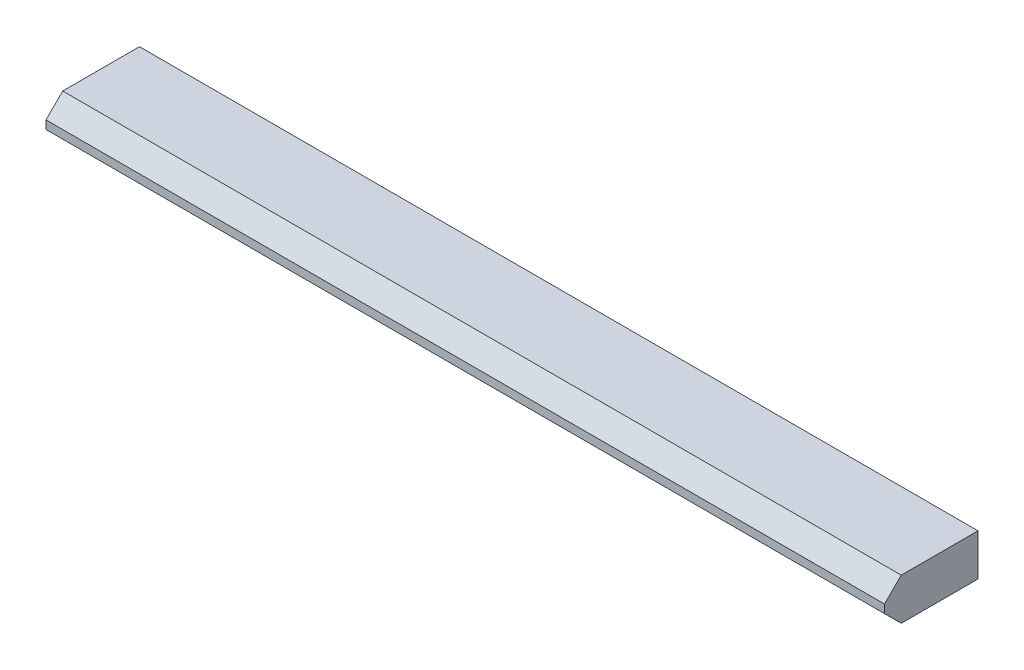
ISO-10303-21;
HEADER;
FILE_DESCRIPTION(('STEP AP214'),'2;1');
FILE_NAME('part.step','',(''),(''),'','','');
FILE_SCHEMA(('AUTOMOTIVE_DESIGN { 1 0 10303 214 1 1 1 1 }'));
ENDSEC;
DATA;
#1=APPLICATION_CONTEXT('core data for automotive mechanical design processes');
#2=APPLICATION_PROTOCOL_DEFINITION('international standard','automotive_design',2000,#1);
#3=PRODUCT_CONTEXT('',#1,'mechanical');
#4=PRODUCT('Part','Part','',(#3));
#5=PRODUCT_RELATED_PRODUCT_CATEGORY('part','',(#4));
#6=PRODUCT_DEFINITION_FORMATION('','',#4);
#7=PRODUCT_DEFINITION_CONTEXT('part definition',#1,'design');
#8=PRODUCT_DEFINITION('design','',#6,#7);
#9=PRODUCT_DEFINITION_SHAPE('','',#8);
#10=(LENGTH_UNIT() NAMED_UNIT(*) SI_UNIT(.MILLI.,.METRE.));
#11=(NAMED_UNIT(*) PLANE_ANGLE_UNIT() SI_UNIT($,.RADIAN.));
#12=(NAMED_UNIT(*) SI_UNIT($,.STERADIAN.) SOLID_ANGLE_UNIT());
#13=UNCERTAINTY_MEASURE_WITH_UNIT(LENGTH_MEASURE(1.E-05),#10,'distance_accuracy_value','');
#14=(GEOMETRIC_REPRESENTATION_CONTEXT(3) GLOBAL_UNCERTAINTY_ASSIGNED_CONTEXT((#13)) GLOBAL_UNIT_ASSIGNED_CONTEXT((#10,
#11,#12)) REPRESENTATION_CONTEXT('',''));
#15=CARTESIAN_POINT('',(0.,0.,0.));
#16=DIRECTION('',(0.,0.,1.));
#17=DIRECTION('',(1.,0.,0.));
#18=AXIS2_PLACEMENT_3D('',#15,#16,#17);
#19=CARTESIAN_POINT('',(-201.,7.7715611723761E-13,25.));
#20=DIRECTION('',(0.,0.,1.));
#21=DIRECTION('',(1.,0.,0.));
#22=AXIS2_PLACEMENT_3D('',#19,#20,#21);
#23=PLANE('',#22);
#24=DIRECTION('',(0.,1.,0.));
#25=VECTOR('',#24,1.);
#26=CARTESIAN_POINT('',(-201.,7.7715611723761E-13,25.));
#27=LINE('',#26,#25);
#28=CARTESIAN_POINT('',(-201.,8.00000000000076,25.));
#29=VERTEX_POINT('',#28);
#30=CARTESIAN_POINT('',(-201.,12.0000000000008,25.));
#31=VERTEX_POINT('',#30);
#32=EDGE_CURVE('E107',#29,#31,#27,.T.);
#33=ORIENTED_EDGE('',*,*,#32,.F.);
#34=DIRECTION('',(1.,0.,0.));
#35=VECTOR('',#34,1.);
#36=CARTESIAN_POINT('',(0.,8.00000000000001,25.));
#37=LINE('',#36,#35);
#38=CARTESIAN_POINT('',(201.,8.00000000000001,25.));
#39=VERTEX_POINT('',#38);
#40=EDGE_CURVE('E81',#39,#29,#37,.F.);
#41=ORIENTED_EDGE('',*,*,#40,.F.);
#42=DIRECTION('',(0.,1.,0.));
#43=VECTOR('',#42,1.);
#44=CARTESIAN_POINT('',(201.,0.,25.));
#45=LINE('',#44,#43);
#46=CARTESIAN_POINT('',(201.,12.,25.));
#47=VERTEX_POINT('',#46);
#48=EDGE_CURVE('E90',#47,#39,#45,.F.);
#49=ORIENTED_EDGE('',*,*,#48,.F.);
#50=DIRECTION('',(1.,0.,0.));
#51=VECTOR('',#50,1.);
#52=CARTESIAN_POINT('',(0.,12.,25.));
#53=LINE('',#52,#51);
#54=EDGE_CURVE('E21',#31,#47,#53,.T.);
#55=ORIENTED_EDGE('',*,*,#54,.F.);
#56=EDGE_LOOP('',(#33,#41,#49,#55));
#57=FACE_BOUND('',#56,.T.);
#58=ADVANCED_FACE('F18',(#57),#23,.T.);
#59=CARTESIAN_POINT('',(0.,16.,21.));
#60=DIRECTION('',(0.,0.707106781186548,0.707106781186548));
#61=DIRECTION('',(0.,-0.707106781186548,0.707106781186548));
#62=AXIS2_PLACEMENT_3D('',#59,#60,#61);
#63=PLANE('',#62);
#64=ORIENTED_EDGE('',*,*,#54,.T.);
#65=DIRECTION('',(0.,-0.707106781186548,0.707106781186548));
#66=VECTOR('',#65,1.);
#67=CARTESIAN_POINT('',(201.,20.,17.));
#68=LINE('',#67,#66);
#69=CARTESIAN_POINT('',(201.,20.,17.));
#70=VERTEX_POINT('',#69);
#71=EDGE_CURVE('E84',#70,#47,#68,.T.);
#72=ORIENTED_EDGE('',*,*,#71,.F.);
#73=DIRECTION('',(1.,0.,0.));
#74=VECTOR('',#73,1.);
#75=CARTESIAN_POINT('',(0.,20.,17.));
#76=LINE('',#75,#74);
#77=CARTESIAN_POINT('',(-201.,20.0000000000008,17.));
#78=VERTEX_POINT('',#77);
#79=EDGE_CURVE('E74',#78,#70,#76,.T.);
#80=ORIENTED_EDGE('',*,*,#79,.F.);
#81=DIRECTION('',(0.,0.707106781186547,-0.707106781186548));
#82=VECTOR('',#81,1.);
#83=CARTESIAN_POINT('',(-201.,12.0000000000008,25.));
#84=LINE('',#83,#82);
#85=EDGE_CURVE('E110',#31,#78,#84,.T.);
#86=ORIENTED_EDGE('',*,*,#85,.F.);
#87=EDGE_LOOP('',(#64,#72,#80,#86));
#88=FACE_BOUND('',#87,.T.);
#89=ADVANCED_FACE('F89',(#88),#63,.T.);
#90=CARTESIAN_POINT('',(0.,20.,0.));
#91=DIRECTION('',(0.,1.,0.));
#92=DIRECTION('',(0.,0.,1.));
#93=AXIS2_PLACEMENT_3D('',#90,#91,#92);
#94=PLANE('',#93);
#95=DIRECTION('',(0.,0.,1.));
#96=VECTOR('',#95,1.);
#97=CARTESIAN_POINT('',(-201.,20.0000000000008,-19.8));
#98=LINE('',#97,#96);
#99=CARTESIAN_POINT('',(-201.,20.0000000000008,-19.8));
#100=VERTEX_POINT('',#99);
#101=EDGE_CURVE('E80',#78,#100,#98,.F.);
#102=ORIENTED_EDGE('',*,*,#101,.F.);
#103=ORIENTED_EDGE('',*,*,#79,.T.);
#104=DIRECTION('',(0.,0.,-1.));
#105=VECTOR('',#104,1.);
#106=CARTESIAN_POINT('',(201.,20.,25.));
#107=LINE('',#106,#105);
#108=CARTESIAN_POINT('',(201.,20.,-19.8));
#109=VERTEX_POINT('',#108);
#110=EDGE_CURVE('E78',#109,#70,#107,.F.);
#111=ORIENTED_EDGE('',*,*,#110,.F.);
#112=DIRECTION('',(-1.,0.,0.));
#113=VECTOR('',#112,1.);
#114=CARTESIAN_POINT('',(201.,20.,-19.8));
#115=LINE('',#114,#113);
#116=EDGE_CURVE('E113',#100,#109,#115,.F.);
#117=ORIENTED_EDGE('',*,*,#116,.F.);
#118=EDGE_LOOP('',(#102,#103,#111,#117));
#119=FACE_BOUND('',#118,.T.);
#120=ADVANCED_FACE('F76',(#119),#94,.T.);
#121=CARTESIAN_POINT('',(0.,4.,21.));
#122=DIRECTION('',(0.,-0.707106781186548,0.707106781186548));
#123=DIRECTION('',(0.,-0.707106781186548,-0.707106781186548));
#124=AXIS2_PLACEMENT_3D('',#121,#122,#123);
#125=PLANE('',#124);
#126=ORIENTED_EDGE('',*,*,#40,.T.);
#127=DIRECTION('',(0.,0.707106781186547,0.707106781186548));
#128=VECTOR('',#127,1.);
#129=CARTESIAN_POINT('',(-201.,7.7715611723761E-13,17.));
#130=LINE('',#129,#128);
#131=CARTESIAN_POINT('',(-201.,7.7715611723761E-13,17.));
#132=VERTEX_POINT('',#131);
#133=EDGE_CURVE('E103',#132,#29,#130,.T.);
#134=ORIENTED_EDGE('',*,*,#133,.F.);
#135=DIRECTION('',(1.,0.,0.));
#136=VECTOR('',#135,1.);
#137=CARTESIAN_POINT('',(0.,0.,17.));
#138=LINE('',#137,#136);
#139=CARTESIAN_POINT('',(201.,0.,17.));
#140=VERTEX_POINT('',#139);
#141=EDGE_CURVE('E108',#132,#140,#138,.T.);
#142=ORIENTED_EDGE('',*,*,#141,.T.);
#143=DIRECTION('',(0.,-0.707106781186548,-0.707106781186548));
#144=VECTOR('',#143,1.);
#145=CARTESIAN_POINT('',(201.,8.00000000000001,25.));
#146=LINE('',#145,#144);
#147=EDGE_CURVE('E92',#39,#140,#146,.T.);
#148=ORIENTED_EDGE('',*,*,#147,.F.);
#149=EDGE_LOOP('',(#126,#134,#142,#148));
#150=FACE_BOUND('',#149,.T.);
#151=ADVANCED_FACE('F101',(#150),#125,.T.);
#152=CARTESIAN_POINT('',(201.,0.,25.));
#153=DIRECTION('',(1.,0.,0.));
#154=DIRECTION('',(0.,0.,-1.));
#155=AXIS2_PLACEMENT_3D('',#152,#153,#154);
#156=PLANE('',#155);
#157=ORIENTED_EDGE('',*,*,#48,.T.);
#158=ORIENTED_EDGE('',*,*,#147,.T.);
#159=DIRECTION('',(0.,0.,1.));
#160=VECTOR('',#159,1.);
#161=CARTESIAN_POINT('',(201.,0.,0.));
#162=LINE('',#161,#160);
#163=CARTESIAN_POINT('',(201.,0.,-19.8));
#164=VERTEX_POINT('',#163);
#165=EDGE_CURVE('E118',#140,#164,#162,.F.);
#166=ORIENTED_EDGE('',*,*,#165,.T.);
#167=DIRECTION('',(0.,1.,0.));
#168=VECTOR('',#167,1.);
#169=CARTESIAN_POINT('',(201.,0.,-19.8));
#170=LINE('',#169,#168);
#171=EDGE_CURVE('E87',#109,#164,#170,.F.);
#172=ORIENTED_EDGE('',*,*,#171,.F.);
#173=ORIENTED_EDGE('',*,*,#110,.T.);
#174=ORIENTED_EDGE('',*,*,#71,.T.);
#175=EDGE_LOOP('',(#157,#158,#166,#172,#173,#174));
#176=FACE_BOUND('',#175,.T.);
#177=ADVANCED_FACE('F83',(#176),#156,.T.);
#178=CARTESIAN_POINT('',(201.,0.,-19.8));
#179=DIRECTION('',(0.,0.,-1.));
#180=DIRECTION('',(-1.,0.,0.));
#181=AXIS2_PLACEMENT_3D('',#178,#179,#180);
#182=PLANE('',#181);
#183=ORIENTED_EDGE('',*,*,#171,.T.);
#184=DIRECTION('',(1.,0.,0.));
#185=VECTOR('',#184,1.);
#186=CARTESIAN_POINT('',(0.,0.,-19.8));
#187=LINE('',#186,#185);
#188=CARTESIAN_POINT('',(-201.,7.7715611723761E-13,-19.8));
#189=VERTEX_POINT('',#188);
#190=EDGE_CURVE('E27',#164,#189,#187,.F.);
#191=ORIENTED_EDGE('',*,*,#190,.T.);
#192=DIRECTION('',(0.,1.,0.));
#193=VECTOR('',#192,1.);
#194=CARTESIAN_POINT('',(-201.,7.7715611723761E-13,-19.8));
#195=LINE('',#194,#193);
#196=EDGE_CURVE('E35',#100,#189,#195,.F.);
#197=ORIENTED_EDGE('',*,*,#196,.F.);
#198=ORIENTED_EDGE('',*,*,#116,.T.);
#199=EDGE_LOOP('',(#183,#191,#197,#198));
#200=FACE_BOUND('',#199,.T.);
#201=ADVANCED_FACE('F128',(#200),#182,.T.);
#202=CARTESIAN_POINT('',(-201.,7.7715611723761E-13,-19.8));
#203=DIRECTION('',(-1.,0.,0.));
#204=DIRECTION('',(0.,0.,1.));
#205=AXIS2_PLACEMENT_3D('',#202,#203,#204);
#206=PLANE('',#205);
#207=DIRECTION('',(0.,0.,1.));
#208=VECTOR('',#207,1.);
#209=CARTESIAN_POINT('',(-201.,7.7715611723761E-13,0.));
#210=LINE('',#209,#208);
#211=EDGE_CURVE('E11',#189,#132,#210,.T.);
#212=ORIENTED_EDGE('',*,*,#211,.T.);
#213=ORIENTED_EDGE('',*,*,#133,.T.);
#214=ORIENTED_EDGE('',*,*,#32,.T.);
#215=ORIENTED_EDGE('',*,*,#85,.T.);
#216=ORIENTED_EDGE('',*,*,#101,.T.);
#217=ORIENTED_EDGE('',*,*,#196,.T.);
#218=EDGE_LOOP('',(#212,#213,#214,#215,#216,#217));
#219=FACE_BOUND('',#218,.T.);
#220=ADVANCED_FACE('F106',(#219),#206,.T.);
#221=CARTESIAN_POINT('',(0.,0.,0.));
#222=DIRECTION('',(0.,1.,0.));
#223=DIRECTION('',(0.,0.,1.));
#224=AXIS2_PLACEMENT_3D('',#221,#222,#223);
#225=PLANE('',#224);
#226=ORIENTED_EDGE('',*,*,#190,.F.);
#227=ORIENTED_EDGE('',*,*,#165,.F.);
#228=ORIENTED_EDGE('',*,*,#141,.F.);
#229=ORIENTED_EDGE('',*,*,#211,.F.);
#230=EDGE_LOOP('',(#226,#227,#228,#229));
#231=FACE_BOUND('',#230,.T.);
#232=ADVANCED_FACE('F121',(#231),#225,.F.);
#233=CLOSED_SHELL('',(#58,#89,#120,#151,#177,#201,#220,#232));
#234=MANIFOLD_SOLID_BREP('B1',#233);
#235=ADVANCED_BREP_SHAPE_REPRESENTATION('',(#18,#234),#14);
#236=SHAPE_DEFINITION_REPRESENTATION(#9,#235);
ENDSEC;
END-ISO-10303-21;
